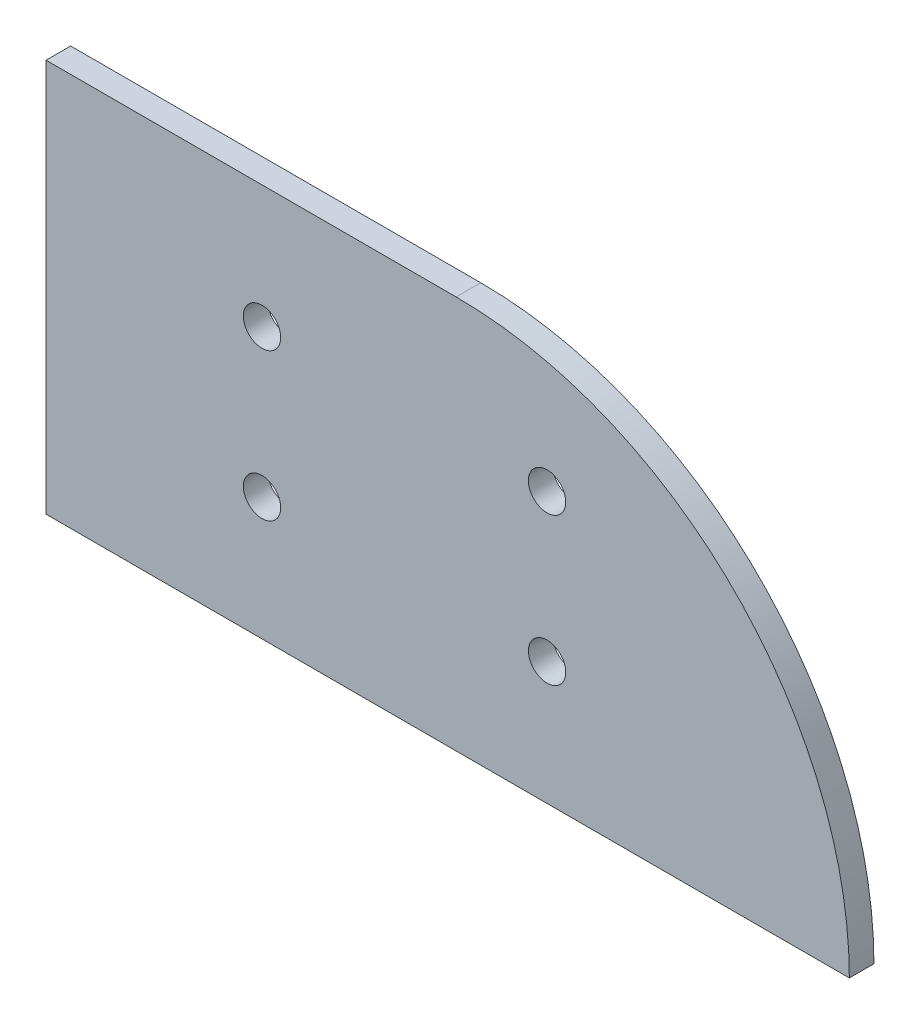
ISO-10303-21;
HEADER;
FILE_DESCRIPTION(('STEP AP214'),'2;1');
FILE_NAME('part.step','',(''),(''),'','','');
FILE_SCHEMA(('AUTOMOTIVE_DESIGN { 1 0 10303 214 1 1 1 1 }'));
ENDSEC;
DATA;
#1=APPLICATION_CONTEXT('core data for automotive mechanical design processes');
#2=APPLICATION_PROTOCOL_DEFINITION('international standard','automotive_design',2000,#1);
#3=PRODUCT_CONTEXT('',#1,'mechanical');
#4=PRODUCT('Part','Part','',(#3));
#5=PRODUCT_RELATED_PRODUCT_CATEGORY('part','',(#4));
#6=PRODUCT_DEFINITION_FORMATION('','',#4);
#7=PRODUCT_DEFINITION_CONTEXT('part definition',#1,'design');
#8=PRODUCT_DEFINITION('design','',#6,#7);
#9=PRODUCT_DEFINITION_SHAPE('','',#8);
#10=(LENGTH_UNIT() NAMED_UNIT(*) SI_UNIT(.MILLI.,.METRE.));
#11=(NAMED_UNIT(*) PLANE_ANGLE_UNIT() SI_UNIT($,.RADIAN.));
#12=(NAMED_UNIT(*) SI_UNIT($,.STERADIAN.) SOLID_ANGLE_UNIT());
#13=UNCERTAINTY_MEASURE_WITH_UNIT(LENGTH_MEASURE(1.E-05),#10,'distance_accuracy_value','');
#14=(GEOMETRIC_REPRESENTATION_CONTEXT(3) GLOBAL_UNCERTAINTY_ASSIGNED_CONTEXT((#13)) GLOBAL_UNIT_ASSIGNED_CONTEXT((#10,
#11,#12)) REPRESENTATION_CONTEXT('',''));
#15=CARTESIAN_POINT('',(0.,0.,0.));
#16=DIRECTION('',(0.,0.,1.));
#17=DIRECTION('',(1.,0.,0.));
#18=AXIS2_PLACEMENT_3D('',#15,#16,#17);
#19=CARTESIAN_POINT('',(52.9789755157234,0.,3.175));
#20=DIRECTION('',(0.,0.,-1.));
#21=DIRECTION('',(-1.,0.,0.));
#22=AXIS2_PLACEMENT_3D('',#19,#20,#21);
#23=CYLINDRICAL_SURFACE('',#22,50.8);
#24=CARTESIAN_POINT('',(52.9789755157234,0.,0.));
#25=DIRECTION('',(0.,0.,1.));
#26=DIRECTION('',(1.,0.,0.));
#27=AXIS2_PLACEMENT_3D('',#24,#25,#26);
#28=CIRCLE('',#27,50.8);
#29=CARTESIAN_POINT('',(103.778975515723,0.,0.));
#30=VERTEX_POINT('',#29);
#31=CARTESIAN_POINT('',(52.9789755157234,50.8,0.));
#32=VERTEX_POINT('',#31);
#33=EDGE_CURVE('E96',#30,#32,#28,.T.);
#34=ORIENTED_EDGE('',*,*,#33,.T.);
#35=DIRECTION('',(0.,0.,-1.));
#36=VECTOR('',#35,1.);
#37=CARTESIAN_POINT('',(52.9789755157234,50.8,3.175));
#38=LINE('',#37,#36);
#39=CARTESIAN_POINT('',(52.9789755157234,50.8,3.175));
#40=VERTEX_POINT('',#39);
#41=EDGE_CURVE('E11',#40,#32,#38,.T.);
#42=ORIENTED_EDGE('',*,*,#41,.F.);
#43=CARTESIAN_POINT('',(52.9789755157234,0.,3.175));
#44=DIRECTION('',(0.,0.,1.));
#45=DIRECTION('',(1.,0.,0.));
#46=AXIS2_PLACEMENT_3D('',#43,#44,#45);
#47=CIRCLE('',#46,50.8);
#48=CARTESIAN_POINT('',(103.778975515723,0.,3.175));
#49=VERTEX_POINT('',#48);
#50=EDGE_CURVE('E84',#49,#40,#47,.T.);
#51=ORIENTED_EDGE('',*,*,#50,.F.);
#52=DIRECTION('',(0.,0.,-1.));
#53=VECTOR('',#52,1.);
#54=CARTESIAN_POINT('',(103.778975515723,0.,3.175));
#55=LINE('',#54,#53);
#56=EDGE_CURVE('E92',#49,#30,#55,.T.);
#57=ORIENTED_EDGE('',*,*,#56,.T.);
#58=EDGE_LOOP('',(#34,#42,#51,#57));
#59=FACE_BOUND('',#58,.T.);
#60=ADVANCED_FACE('F33',(#59),#23,.T.);
#61=CARTESIAN_POINT('',(52.9789755157234,50.8,3.175));
#62=DIRECTION('',(0.,-1.,0.));
#63=DIRECTION('',(1.,0.,0.));
#64=AXIS2_PLACEMENT_3D('',#61,#62,#63);
#65=PLANE('',#64);
#66=DIRECTION('',(-1.,0.,0.));
#67=VECTOR('',#66,1.);
#68=CARTESIAN_POINT('',(52.9789755157234,50.8,0.));
#69=LINE('',#68,#67);
#70=CARTESIAN_POINT('',(0.,50.8,0.));
#71=VERTEX_POINT('',#70);
#72=EDGE_CURVE('E88',#32,#71,#69,.T.);
#73=ORIENTED_EDGE('',*,*,#72,.T.);
#74=DIRECTION('',(0.,0.,-1.));
#75=VECTOR('',#74,1.);
#76=CARTESIAN_POINT('',(0.,50.8,3.175));
#77=LINE('',#76,#75);
#78=CARTESIAN_POINT('',(0.,50.8,3.175));
#79=VERTEX_POINT('',#78);
#80=EDGE_CURVE('E41',#79,#71,#77,.T.);
#81=ORIENTED_EDGE('',*,*,#80,.F.);
#82=DIRECTION('',(-1.,0.,0.));
#83=VECTOR('',#82,1.);
#84=CARTESIAN_POINT('',(52.9789755157234,50.8,3.175));
#85=LINE('',#84,#83);
#86=EDGE_CURVE('E79',#40,#79,#85,.T.);
#87=ORIENTED_EDGE('',*,*,#86,.F.);
#88=ORIENTED_EDGE('',*,*,#41,.T.);
#89=EDGE_LOOP('',(#73,#81,#87,#88));
#90=FACE_BOUND('',#89,.T.);
#91=ADVANCED_FACE('F87',(#90),#65,.F.);
#92=CARTESIAN_POINT('',(0.,50.8,3.175));
#93=DIRECTION('',(1.,0.,0.));
#94=DIRECTION('',(0.,0.,-1.));
#95=AXIS2_PLACEMENT_3D('',#92,#93,#94);
#96=PLANE('',#95);
#97=DIRECTION('',(0.,-1.,0.));
#98=VECTOR('',#97,1.);
#99=CARTESIAN_POINT('',(0.,50.8,0.));
#100=LINE('',#99,#98);
#101=CARTESIAN_POINT('',(0.,0.,0.));
#102=VERTEX_POINT('',#101);
#103=EDGE_CURVE('E66',#71,#102,#100,.T.);
#104=ORIENTED_EDGE('',*,*,#103,.T.);
#105=DIRECTION('',(0.,0.,-1.));
#106=VECTOR('',#105,1.);
#107=CARTESIAN_POINT('',(0.,0.,3.175));
#108=LINE('',#107,#106);
#109=CARTESIAN_POINT('',(0.,0.,3.175));
#110=VERTEX_POINT('',#109);
#111=EDGE_CURVE('E89',#110,#102,#108,.T.);
#112=ORIENTED_EDGE('',*,*,#111,.F.);
#113=DIRECTION('',(0.,-1.,0.));
#114=VECTOR('',#113,1.);
#115=CARTESIAN_POINT('',(0.,50.8,3.175));
#116=LINE('',#115,#114);
#117=EDGE_CURVE('E82',#79,#110,#116,.T.);
#118=ORIENTED_EDGE('',*,*,#117,.F.);
#119=ORIENTED_EDGE('',*,*,#80,.T.);
#120=EDGE_LOOP('',(#104,#112,#118,#119));
#121=FACE_BOUND('',#120,.T.);
#122=ADVANCED_FACE('F90',(#121),#96,.F.);
#123=CARTESIAN_POINT('',(0.,0.,3.175));
#124=DIRECTION('',(0.,1.,0.));
#125=DIRECTION('',(0.,0.,1.));
#126=AXIS2_PLACEMENT_3D('',#123,#124,#125);
#127=PLANE('',#126);
#128=DIRECTION('',(1.,0.,0.));
#129=VECTOR('',#128,1.);
#130=CARTESIAN_POINT('',(0.,0.,0.));
#131=LINE('',#130,#129);
#132=EDGE_CURVE('E72',#102,#30,#131,.T.);
#133=ORIENTED_EDGE('',*,*,#132,.T.);
#134=ORIENTED_EDGE('',*,*,#56,.F.);
#135=DIRECTION('',(1.,0.,0.));
#136=VECTOR('',#135,1.);
#137=CARTESIAN_POINT('',(0.,0.,3.175));
#138=LINE('',#137,#136);
#139=EDGE_CURVE('E49',#110,#49,#138,.T.);
#140=ORIENTED_EDGE('',*,*,#139,.F.);
#141=ORIENTED_EDGE('',*,*,#111,.T.);
#142=EDGE_LOOP('',(#133,#134,#140,#141));
#143=FACE_BOUND('',#142,.T.);
#144=ADVANCED_FACE('F104',(#143),#127,.F.);
#145=CARTESIAN_POINT('',(52.9789755157234,0.,3.175));
#146=DIRECTION('',(0.,0.,1.));
#147=DIRECTION('',(1.,0.,0.));
#148=AXIS2_PLACEMENT_3D('',#145,#146,#147);
#149=PLANE('',#148);
#150=CARTESIAN_POINT('',(64.7264755157234,15.8750000000021,3.175));
#151=DIRECTION('',(0.,0.,1.));
#152=DIRECTION('',(1.,0.,0.));
#153=AXIS2_PLACEMENT_3D('',#150,#151,#152);
#154=CIRCLE('',#153,2.41300000000005);
#155=CARTESIAN_POINT('',(67.1394755157234,15.8750000000021,3.175));
#156=VERTEX_POINT('',#155);
#157=EDGE_CURVE('E99',#156,#156,#154,.T.);
#158=ORIENTED_EDGE('',*,*,#157,.F.);
#159=EDGE_LOOP('',(#158));
#160=FACE_BOUND('',#159,.T.);
#161=CARTESIAN_POINT('',(27.8964755157234,15.8750000000021,3.175));
#162=DIRECTION('',(0.,0.,1.));
#163=DIRECTION('',(1.,0.,0.));
#164=AXIS2_PLACEMENT_3D('',#161,#162,#163);
#165=CIRCLE('',#164,2.41300000000004);
#166=CARTESIAN_POINT('',(30.3094755157234,15.8750000000021,3.175));
#167=VERTEX_POINT('',#166);
#168=EDGE_CURVE('E112',#167,#167,#165,.T.);
#169=ORIENTED_EDGE('',*,*,#168,.F.);
#170=EDGE_LOOP('',(#169));
#171=FACE_BOUND('',#170,.T.);
#172=CARTESIAN_POINT('',(27.8964755157234,34.9250000000021,3.175));
#173=DIRECTION('',(0.,0.,1.));
#174=DIRECTION('',(1.,0.,0.));
#175=AXIS2_PLACEMENT_3D('',#172,#173,#174);
#176=CIRCLE('',#175,2.41300000000004);
#177=CARTESIAN_POINT('',(30.3094755157234,34.9250000000021,3.175));
#178=VERTEX_POINT('',#177);
#179=EDGE_CURVE('E115',#178,#178,#176,.T.);
#180=ORIENTED_EDGE('',*,*,#179,.F.);
#181=EDGE_LOOP('',(#180));
#182=FACE_BOUND('',#181,.T.);
#183=CARTESIAN_POINT('',(64.7264755157234,34.9250000000021,3.175));
#184=DIRECTION('',(0.,0.,1.));
#185=DIRECTION('',(1.,0.,0.));
#186=AXIS2_PLACEMENT_3D('',#183,#184,#185);
#187=CIRCLE('',#186,2.41300000000005);
#188=CARTESIAN_POINT('',(67.1394755157234,34.9250000000021,3.175));
#189=VERTEX_POINT('',#188);
#190=EDGE_CURVE('E118',#189,#189,#187,.T.);
#191=ORIENTED_EDGE('',*,*,#190,.F.);
#192=EDGE_LOOP('',(#191));
#193=FACE_BOUND('',#192,.T.);
#194=ORIENTED_EDGE('',*,*,#50,.T.);
#195=ORIENTED_EDGE('',*,*,#86,.T.);
#196=ORIENTED_EDGE('',*,*,#117,.T.);
#197=ORIENTED_EDGE('',*,*,#139,.T.);
#198=EDGE_LOOP('',(#194,#195,#196,#197));
#199=FACE_BOUND('',#198,.T.);
#200=ADVANCED_FACE('F80',(#160,#171,#182,#193,#199),#149,.T.);
#201=CARTESIAN_POINT('',(52.9789755157234,0.,0.));
#202=DIRECTION('',(0.,0.,1.));
#203=DIRECTION('',(1.,0.,0.));
#204=AXIS2_PLACEMENT_3D('',#201,#202,#203);
#205=PLANE('',#204);
#206=CARTESIAN_POINT('',(64.7264755157234,15.8750000000021,0.));
#207=DIRECTION('',(0.,0.,1.));
#208=DIRECTION('',(1.,0.,0.));
#209=AXIS2_PLACEMENT_3D('',#206,#207,#208);
#210=CIRCLE('',#209,2.41300000000005);
#211=CARTESIAN_POINT('',(67.1394755157234,15.8750000000021,0.));
#212=VERTEX_POINT('',#211);
#213=EDGE_CURVE('E125',#212,#212,#210,.T.);
#214=ORIENTED_EDGE('',*,*,#213,.T.);
#215=EDGE_LOOP('',(#214));
#216=FACE_BOUND('',#215,.T.);
#217=CARTESIAN_POINT('',(27.8964755157234,15.8750000000021,0.));
#218=DIRECTION('',(0.,0.,1.));
#219=DIRECTION('',(1.,0.,0.));
#220=AXIS2_PLACEMENT_3D('',#217,#218,#219);
#221=CIRCLE('',#220,2.41300000000004);
#222=CARTESIAN_POINT('',(30.3094755157234,15.8750000000021,0.));
#223=VERTEX_POINT('',#222);
#224=EDGE_CURVE('E128',#223,#223,#221,.T.);
#225=ORIENTED_EDGE('',*,*,#224,.T.);
#226=EDGE_LOOP('',(#225));
#227=FACE_BOUND('',#226,.T.);
#228=CARTESIAN_POINT('',(27.8964755157234,34.9250000000021,0.));
#229=DIRECTION('',(0.,0.,1.));
#230=DIRECTION('',(1.,0.,0.));
#231=AXIS2_PLACEMENT_3D('',#228,#229,#230);
#232=CIRCLE('',#231,2.41300000000004);
#233=CARTESIAN_POINT('',(30.3094755157234,34.9250000000021,0.));
#234=VERTEX_POINT('',#233);
#235=EDGE_CURVE('E124',#234,#234,#232,.T.);
#236=ORIENTED_EDGE('',*,*,#235,.T.);
#237=EDGE_LOOP('',(#236));
#238=FACE_BOUND('',#237,.T.);
#239=CARTESIAN_POINT('',(64.7264755157234,34.9250000000021,0.));
#240=DIRECTION('',(0.,0.,1.));
#241=DIRECTION('',(1.,0.,0.));
#242=AXIS2_PLACEMENT_3D('',#239,#240,#241);
#243=CIRCLE('',#242,2.41300000000005);
#244=CARTESIAN_POINT('',(67.1394755157234,34.9250000000021,0.));
#245=VERTEX_POINT('',#244);
#246=EDGE_CURVE('E121',#245,#245,#243,.T.);
#247=ORIENTED_EDGE('',*,*,#246,.T.);
#248=EDGE_LOOP('',(#247));
#249=FACE_BOUND('',#248,.T.);
#250=ORIENTED_EDGE('',*,*,#33,.F.);
#251=ORIENTED_EDGE('',*,*,#132,.F.);
#252=ORIENTED_EDGE('',*,*,#103,.F.);
#253=ORIENTED_EDGE('',*,*,#72,.F.);
#254=EDGE_LOOP('',(#250,#251,#252,#253));
#255=FACE_BOUND('',#254,.T.);
#256=ADVANCED_FACE('F107',(#216,#227,#238,#249,#255),#205,.F.);
#257=CARTESIAN_POINT('',(64.7264755157234,34.9250000000021,0.));
#258=DIRECTION('',(0.,0.,1.));
#259=DIRECTION('',(1.,0.,0.));
#260=AXIS2_PLACEMENT_3D('',#257,#258,#259);
#261=CYLINDRICAL_SURFACE('',#260,2.41300000000005);
#262=ORIENTED_EDGE('',*,*,#190,.T.);
#263=EDGE_LOOP('',(#262));
#264=FACE_BOUND('',#263,.T.);
#265=ORIENTED_EDGE('',*,*,#246,.F.);
#266=EDGE_LOOP('',(#265));
#267=FACE_BOUND('',#266,.T.);
#268=ADVANCED_FACE('F139',(#264,#267),#261,.F.);
#269=CARTESIAN_POINT('',(27.8964755157234,34.9250000000021,0.));
#270=DIRECTION('',(0.,0.,1.));
#271=DIRECTION('',(1.,0.,0.));
#272=AXIS2_PLACEMENT_3D('',#269,#270,#271);
#273=CYLINDRICAL_SURFACE('',#272,2.41300000000004);
#274=ORIENTED_EDGE('',*,*,#179,.T.);
#275=EDGE_LOOP('',(#274));
#276=FACE_BOUND('',#275,.T.);
#277=ORIENTED_EDGE('',*,*,#235,.F.);
#278=EDGE_LOOP('',(#277));
#279=FACE_BOUND('',#278,.T.);
#280=ADVANCED_FACE('F136',(#276,#279),#273,.F.);
#281=CARTESIAN_POINT('',(27.8964755157234,15.8750000000021,0.));
#282=DIRECTION('',(0.,0.,1.));
#283=DIRECTION('',(1.,0.,0.));
#284=AXIS2_PLACEMENT_3D('',#281,#282,#283);
#285=CYLINDRICAL_SURFACE('',#284,2.41300000000004);
#286=ORIENTED_EDGE('',*,*,#168,.T.);
#287=EDGE_LOOP('',(#286));
#288=FACE_BOUND('',#287,.T.);
#289=ORIENTED_EDGE('',*,*,#224,.F.);
#290=EDGE_LOOP('',(#289));
#291=FACE_BOUND('',#290,.T.);
#292=ADVANCED_FACE('F138',(#288,#291),#285,.F.);
#293=CARTESIAN_POINT('',(64.7264755157234,15.8750000000021,0.));
#294=DIRECTION('',(0.,0.,1.));
#295=DIRECTION('',(1.,0.,0.));
#296=AXIS2_PLACEMENT_3D('',#293,#294,#295);
#297=CYLINDRICAL_SURFACE('',#296,2.41300000000005);
#298=ORIENTED_EDGE('',*,*,#157,.T.);
#299=EDGE_LOOP('',(#298));
#300=FACE_BOUND('',#299,.T.);
#301=ORIENTED_EDGE('',*,*,#213,.F.);
#302=EDGE_LOOP('',(#301));
#303=FACE_BOUND('',#302,.T.);
#304=ADVANCED_FACE('F146',(#300,#303),#297,.F.);
#305=CLOSED_SHELL('',(#60,#91,#122,#144,#200,#256,#268,#280,#292,#304));
#306=MANIFOLD_SOLID_BREP('B2',#305);
#307=ADVANCED_BREP_SHAPE_REPRESENTATION('',(#18,#306),#14);
#308=SHAPE_DEFINITION_REPRESENTATION(#9,#307);
ENDSEC;
END-ISO-10303-21;
